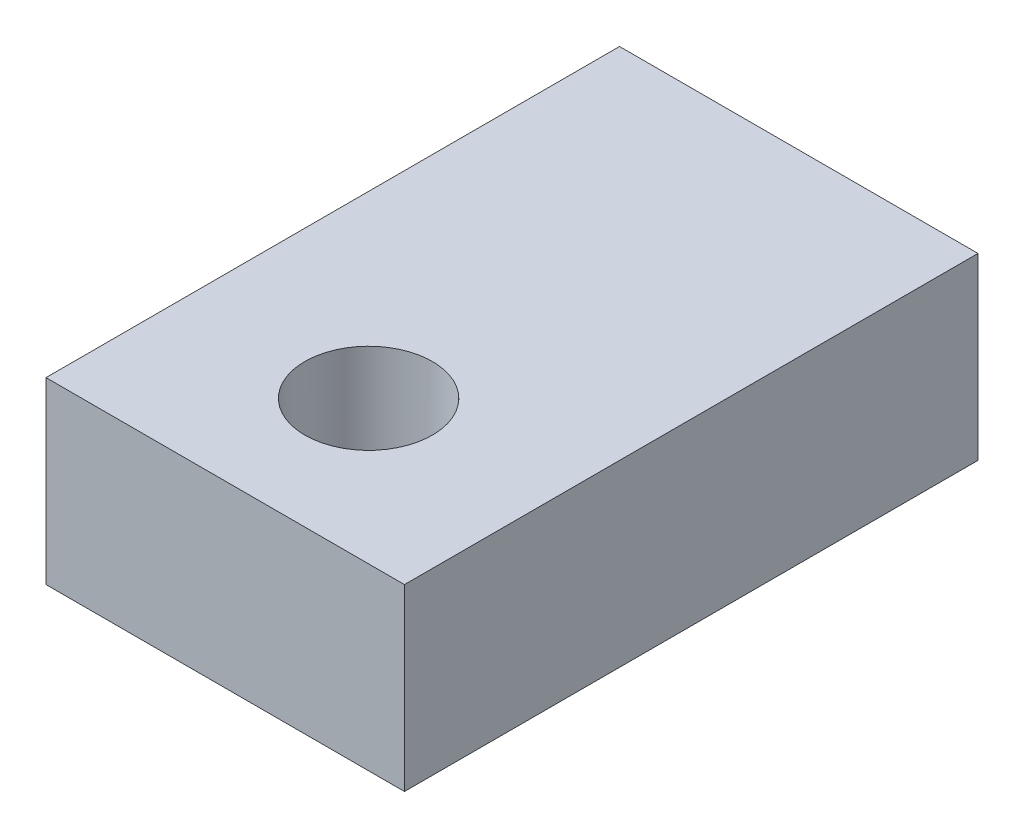
ISO-10303-21;
HEADER;
FILE_DESCRIPTION(('STEP AP214'),'2;1');
FILE_NAME('part.step','',(''),(''),'','','');
FILE_SCHEMA(('AUTOMOTIVE_DESIGN { 1 0 10303 214 1 1 1 1 }'));
ENDSEC;
DATA;
#1=APPLICATION_CONTEXT('core data for automotive mechanical design processes');
#2=APPLICATION_PROTOCOL_DEFINITION('international standard','automotive_design',2000,#1);
#3=PRODUCT_CONTEXT('',#1,'mechanical');
#4=PRODUCT('Part','Part','',(#3));
#5=PRODUCT_RELATED_PRODUCT_CATEGORY('part','',(#4));
#6=PRODUCT_DEFINITION_FORMATION('','',#4);
#7=PRODUCT_DEFINITION_CONTEXT('part definition',#1,'design');
#8=PRODUCT_DEFINITION('design','',#6,#7);
#9=PRODUCT_DEFINITION_SHAPE('','',#8);
#10=(LENGTH_UNIT() NAMED_UNIT(*) SI_UNIT(.MILLI.,.METRE.));
#11=(NAMED_UNIT(*) PLANE_ANGLE_UNIT() SI_UNIT($,.RADIAN.));
#12=(NAMED_UNIT(*) SI_UNIT($,.STERADIAN.) SOLID_ANGLE_UNIT());
#13=UNCERTAINTY_MEASURE_WITH_UNIT(LENGTH_MEASURE(1.E-05),#10,'distance_accuracy_value','');
#14=(GEOMETRIC_REPRESENTATION_CONTEXT(3) GLOBAL_UNCERTAINTY_ASSIGNED_CONTEXT((#13)) GLOBAL_UNIT_ASSIGNED_CONTEXT((#10,
#11,#12)) REPRESENTATION_CONTEXT('',''));
#15=CARTESIAN_POINT('',(0.,0.,0.));
#16=DIRECTION('',(0.,0.,1.));
#17=DIRECTION('',(1.,0.,0.));
#18=AXIS2_PLACEMENT_3D('',#15,#16,#17);
#19=CARTESIAN_POINT('',(3.175,3.175,5.08));
#20=DIRECTION('',(-1.,0.,0.));
#21=DIRECTION('',(0.,0.,1.));
#22=AXIS2_PLACEMENT_3D('',#19,#20,#21);
#23=PLANE('',#22);
#24=DIRECTION('',(0.,0.,-1.));
#25=VECTOR('',#24,1.);
#26=CARTESIAN_POINT('',(3.175,0.,5.08));
#27=LINE('',#26,#25);
#28=CARTESIAN_POINT('',(3.175,0.,5.08));
#29=VERTEX_POINT('',#28);
#30=CARTESIAN_POINT('',(3.175,0.,-5.08));
#31=VERTEX_POINT('',#30);
#32=EDGE_CURVE('E115',#29,#31,#27,.T.);
#33=ORIENTED_EDGE('',*,*,#32,.T.);
#34=DIRECTION('',(0.,-1.,0.));
#35=VECTOR('',#34,1.);
#36=CARTESIAN_POINT('',(3.175,3.175,-5.08));
#37=LINE('',#36,#35);
#38=CARTESIAN_POINT('',(3.175,3.175,-5.08));
#39=VERTEX_POINT('',#38);
#40=EDGE_CURVE('E11',#39,#31,#37,.T.);
#41=ORIENTED_EDGE('',*,*,#40,.F.);
#42=DIRECTION('',(0.,0.,-1.));
#43=VECTOR('',#42,1.);
#44=CARTESIAN_POINT('',(3.175,3.175,5.08));
#45=LINE('',#44,#43);
#46=CARTESIAN_POINT('',(3.175,3.175,5.08));
#47=VERTEX_POINT('',#46);
#48=EDGE_CURVE('E99',#47,#39,#45,.T.);
#49=ORIENTED_EDGE('',*,*,#48,.F.);
#50=DIRECTION('',(0.,-1.,0.));
#51=VECTOR('',#50,1.);
#52=CARTESIAN_POINT('',(3.175,3.175,5.08));
#53=LINE('',#52,#51);
#54=EDGE_CURVE('E111',#47,#29,#53,.T.);
#55=ORIENTED_EDGE('',*,*,#54,.T.);
#56=EDGE_LOOP('',(#33,#41,#49,#55));
#57=FACE_BOUND('',#56,.T.);
#58=ADVANCED_FACE('F47',(#57),#23,.F.);
#59=CARTESIAN_POINT('',(-3.175,3.175,-5.08));
#60=DIRECTION('',(0.,0.,1.));
#61=DIRECTION('',(1.,0.,0.));
#62=AXIS2_PLACEMENT_3D('',#59,#60,#61);
#63=PLANE('',#62);
#64=DIRECTION('',(-1.,0.,0.));
#65=VECTOR('',#64,1.);
#66=CARTESIAN_POINT('',(-3.175,0.,-5.08));
#67=LINE('',#66,#65);
#68=CARTESIAN_POINT('',(-3.175,0.,-5.08));
#69=VERTEX_POINT('',#68);
#70=EDGE_CURVE('E104',#31,#69,#67,.T.);
#71=ORIENTED_EDGE('',*,*,#70,.T.);
#72=DIRECTION('',(0.,-1.,0.));
#73=VECTOR('',#72,1.);
#74=CARTESIAN_POINT('',(-3.175,3.175,-5.08));
#75=LINE('',#74,#73);
#76=CARTESIAN_POINT('',(-3.175,3.175,-5.08));
#77=VERTEX_POINT('',#76);
#78=EDGE_CURVE('E56',#77,#69,#75,.T.);
#79=ORIENTED_EDGE('',*,*,#78,.F.);
#80=DIRECTION('',(-1.,0.,0.));
#81=VECTOR('',#80,1.);
#82=CARTESIAN_POINT('',(-3.175,3.175,-5.08));
#83=LINE('',#82,#81);
#84=EDGE_CURVE('E94',#39,#77,#83,.T.);
#85=ORIENTED_EDGE('',*,*,#84,.F.);
#86=ORIENTED_EDGE('',*,*,#40,.T.);
#87=EDGE_LOOP('',(#71,#79,#85,#86));
#88=FACE_BOUND('',#87,.T.);
#89=ADVANCED_FACE('F103',(#88),#63,.F.);
#90=CARTESIAN_POINT('',(-3.175,3.175,5.08));
#91=DIRECTION('',(1.,0.,0.));
#92=DIRECTION('',(0.,0.,-1.));
#93=AXIS2_PLACEMENT_3D('',#90,#91,#92);
#94=PLANE('',#93);
#95=DIRECTION('',(0.,0.,1.));
#96=VECTOR('',#95,1.);
#97=CARTESIAN_POINT('',(-3.175,0.,5.08));
#98=LINE('',#97,#96);
#99=CARTESIAN_POINT('',(-3.175,0.,5.08));
#100=VERTEX_POINT('',#99);
#101=EDGE_CURVE('E81',#69,#100,#98,.T.);
#102=ORIENTED_EDGE('',*,*,#101,.T.);
#103=DIRECTION('',(0.,-1.,0.));
#104=VECTOR('',#103,1.);
#105=CARTESIAN_POINT('',(-3.175,3.175,5.08));
#106=LINE('',#105,#104);
#107=CARTESIAN_POINT('',(-3.175,3.175,5.08));
#108=VERTEX_POINT('',#107);
#109=EDGE_CURVE('E106',#108,#100,#106,.T.);
#110=ORIENTED_EDGE('',*,*,#109,.F.);
#111=DIRECTION('',(0.,0.,1.));
#112=VECTOR('',#111,1.);
#113=CARTESIAN_POINT('',(-3.175,3.175,5.08));
#114=LINE('',#113,#112);
#115=EDGE_CURVE('E97',#77,#108,#114,.T.);
#116=ORIENTED_EDGE('',*,*,#115,.F.);
#117=ORIENTED_EDGE('',*,*,#78,.T.);
#118=EDGE_LOOP('',(#102,#110,#116,#117));
#119=FACE_BOUND('',#118,.T.);
#120=ADVANCED_FACE('F107',(#119),#94,.F.);
#121=CARTESIAN_POINT('',(-3.175,3.175,5.08));
#122=DIRECTION('',(0.,0.,-1.));
#123=DIRECTION('',(-1.,0.,0.));
#124=AXIS2_PLACEMENT_3D('',#121,#122,#123);
#125=PLANE('',#124);
#126=DIRECTION('',(1.,0.,0.));
#127=VECTOR('',#126,1.);
#128=CARTESIAN_POINT('',(-3.175,0.,5.08));
#129=LINE('',#128,#127);
#130=EDGE_CURVE('E87',#100,#29,#129,.T.);
#131=ORIENTED_EDGE('',*,*,#130,.T.);
#132=ORIENTED_EDGE('',*,*,#54,.F.);
#133=DIRECTION('',(1.,0.,0.));
#134=VECTOR('',#133,1.);
#135=CARTESIAN_POINT('',(-3.175,3.175,5.08));
#136=LINE('',#135,#134);
#137=EDGE_CURVE('E64',#108,#47,#136,.T.);
#138=ORIENTED_EDGE('',*,*,#137,.F.);
#139=ORIENTED_EDGE('',*,*,#109,.T.);
#140=EDGE_LOOP('',(#131,#132,#138,#139));
#141=FACE_BOUND('',#140,.T.);
#142=ADVANCED_FACE('F129',(#141),#125,.F.);
#143=CARTESIAN_POINT('',(0.,3.175,0.));
#144=DIRECTION('',(0.,-1.,0.));
#145=DIRECTION('',(0.,0.,-1.));
#146=AXIS2_PLACEMENT_3D('',#143,#144,#145);
#147=PLANE('',#146);
#148=CARTESIAN_POINT('',(0.,3.175,2.54));
#149=DIRECTION('',(0.,1.,0.));
#150=DIRECTION('',(0.,0.,1.));
#151=AXIS2_PLACEMENT_3D('',#148,#149,#150);
#152=CIRCLE('',#151,1.1303);
#153=CARTESIAN_POINT('',(0.,3.175,3.6703));
#154=VERTEX_POINT('',#153);
#155=EDGE_CURVE('E139',#154,#154,#152,.T.);
#156=ORIENTED_EDGE('',*,*,#155,.F.);
#157=EDGE_LOOP('',(#156));
#158=FACE_BOUND('',#157,.T.);
#159=ORIENTED_EDGE('',*,*,#48,.T.);
#160=ORIENTED_EDGE('',*,*,#84,.T.);
#161=ORIENTED_EDGE('',*,*,#115,.T.);
#162=ORIENTED_EDGE('',*,*,#137,.T.);
#163=EDGE_LOOP('',(#159,#160,#161,#162));
#164=FACE_BOUND('',#163,.T.);
#165=ADVANCED_FACE('F95',(#158,#164),#147,.F.);
#166=CARTESIAN_POINT('',(0.,0.,0.));
#167=DIRECTION('',(0.,-1.,0.));
#168=DIRECTION('',(0.,0.,-1.));
#169=AXIS2_PLACEMENT_3D('',#166,#167,#168);
#170=PLANE('',#169);
#171=CARTESIAN_POINT('',(0.,0.,2.54));
#172=DIRECTION('',(0.,-1.,0.));
#173=DIRECTION('',(0.,0.,-1.));
#174=AXIS2_PLACEMENT_3D('',#171,#172,#173);
#175=CIRCLE('',#174,1.1303);
#176=CARTESIAN_POINT('',(0.,0.,1.4097));
#177=VERTEX_POINT('',#176);
#178=EDGE_CURVE('E119',#177,#177,#175,.T.);
#179=ORIENTED_EDGE('',*,*,#178,.F.);
#180=EDGE_LOOP('',(#179));
#181=FACE_BOUND('',#180,.T.);
#182=ORIENTED_EDGE('',*,*,#32,.F.);
#183=ORIENTED_EDGE('',*,*,#130,.F.);
#184=ORIENTED_EDGE('',*,*,#101,.F.);
#185=ORIENTED_EDGE('',*,*,#70,.F.);
#186=EDGE_LOOP('',(#182,#183,#184,#185));
#187=FACE_BOUND('',#186,.T.);
#188=ADVANCED_FACE('F132',(#181,#187),#170,.T.);
#189=CARTESIAN_POINT('',(0.,3.175,2.54));
#190=DIRECTION('',(0.,1.,0.));
#191=DIRECTION('',(0.,0.,1.));
#192=AXIS2_PLACEMENT_3D('',#189,#190,#191);
#193=CYLINDRICAL_SURFACE('',#192,1.1303);
#194=ORIENTED_EDGE('',*,*,#178,.T.);
#195=EDGE_LOOP('',(#194));
#196=FACE_BOUND('',#195,.T.);
#197=ORIENTED_EDGE('',*,*,#155,.T.);
#198=EDGE_LOOP('',(#197));
#199=FACE_BOUND('',#198,.T.);
#200=ADVANCED_FACE('F144',(#196,#199),#193,.F.);
#201=CLOSED_SHELL('',(#58,#89,#120,#142,#165,#188,#200));
#202=MANIFOLD_SOLID_BREP('B2',#201);
#203=ADVANCED_BREP_SHAPE_REPRESENTATION('',(#18,#202),#14);
#204=SHAPE_DEFINITION_REPRESENTATION(#9,#203);
ENDSEC;
END-ISO-10303-21;
